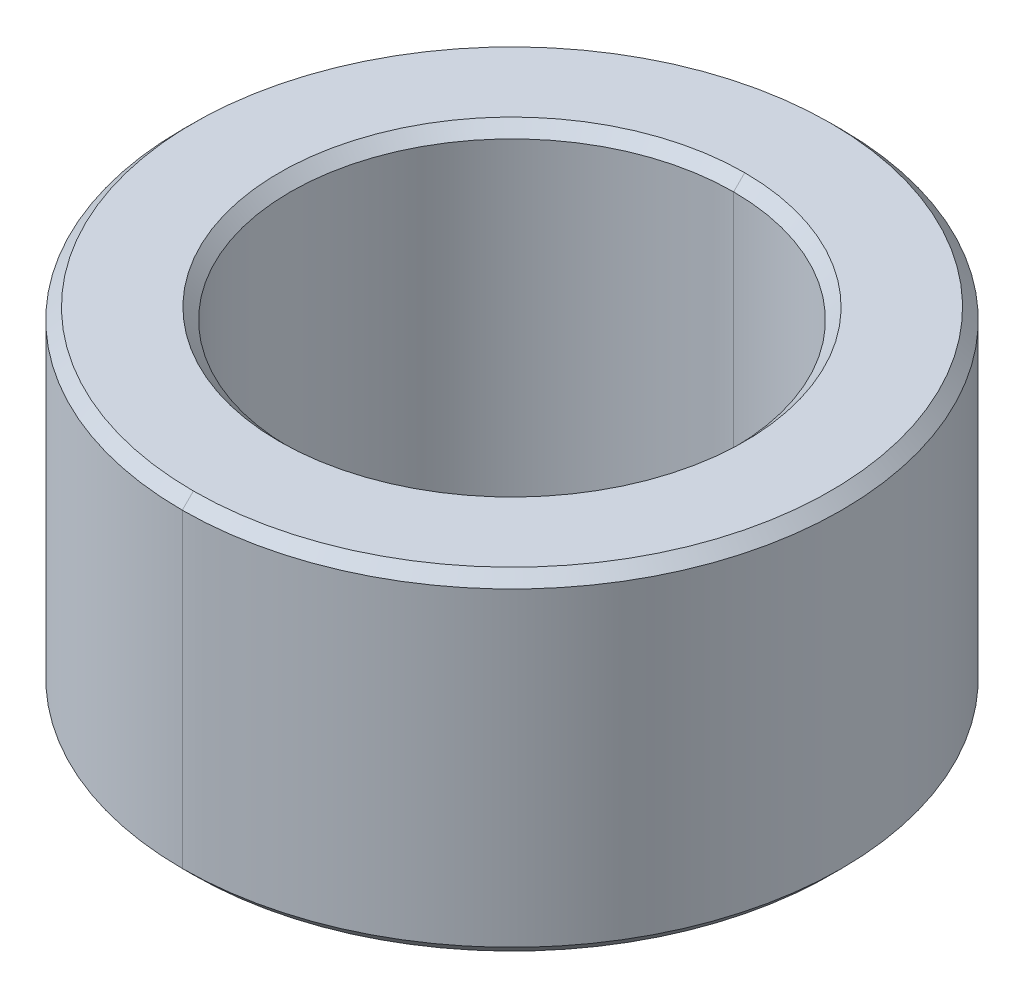
ISO-10303-21;
HEADER;
FILE_DESCRIPTION(('STEP AP214'),'2;1');
FILE_NAME('part.step','',(''),(''),'','','');
FILE_SCHEMA(('AUTOMOTIVE_DESIGN { 1 0 10303 214 1 1 1 1 }'));
ENDSEC;
DATA;
#1=APPLICATION_CONTEXT('core data for automotive mechanical design processes');
#2=APPLICATION_PROTOCOL_DEFINITION('international standard','automotive_design',2000,#1);
#3=PRODUCT_CONTEXT('',#1,'mechanical');
#4=PRODUCT('Part','Part','',(#3));
#5=PRODUCT_RELATED_PRODUCT_CATEGORY('part','',(#4));
#6=PRODUCT_DEFINITION_FORMATION('','',#4);
#7=PRODUCT_DEFINITION_CONTEXT('part definition',#1,'design');
#8=PRODUCT_DEFINITION('design','',#6,#7);
#9=PRODUCT_DEFINITION_SHAPE('','',#8);
#10=(LENGTH_UNIT() NAMED_UNIT(*) SI_UNIT(.MILLI.,.METRE.));
#11=(NAMED_UNIT(*) PLANE_ANGLE_UNIT() SI_UNIT($,.RADIAN.));
#12=(NAMED_UNIT(*) SI_UNIT($,.STERADIAN.) SOLID_ANGLE_UNIT());
#13=UNCERTAINTY_MEASURE_WITH_UNIT(LENGTH_MEASURE(1.E-05),#10,'distance_accuracy_value','');
#14=(GEOMETRIC_REPRESENTATION_CONTEXT(3) GLOBAL_UNCERTAINTY_ASSIGNED_CONTEXT((#13)) GLOBAL_UNIT_ASSIGNED_CONTEXT((#10,
#11,#12)) REPRESENTATION_CONTEXT('',''));
#15=CARTESIAN_POINT('',(0.,0.,0.));
#16=DIRECTION('',(0.,0.,1.));
#17=DIRECTION('',(1.,0.,0.));
#18=AXIS2_PLACEMENT_3D('',#15,#16,#17);
#19=CARTESIAN_POINT('',(0.,1.4,0.));
#20=DIRECTION('',(0.,1.,0.));
#21=DIRECTION('',(0.,0.,1.));
#22=AXIS2_PLACEMENT_3D('',#19,#20,#21);
#23=CONICAL_SURFACE('',#22,2.,0.78539816339745);
#24=CARTESIAN_POINT('',(0.,1.4,0.));
#25=DIRECTION('',(0.,1.,0.));
#26=DIRECTION('',(0.,0.,1.));
#27=AXIS2_PLACEMENT_3D('',#24,#25,#26);
#28=CIRCLE('',#27,2.);
#29=CARTESIAN_POINT('',(0.,1.4,-2.));
#30=VERTEX_POINT('',#29);
#31=CARTESIAN_POINT('',(0.,1.4,2.));
#32=VERTEX_POINT('',#31);
#33=EDGE_CURVE('E147',#30,#32,#28,.T.);
#34=ORIENTED_EDGE('',*,*,#33,.F.);
#35=DIRECTION('',(0.,0.707106781186546,-0.707106781186549));
#36=VECTOR('',#35,1.);
#37=CARTESIAN_POINT('',(0.,1.4,-2.));
#38=LINE('',#37,#36);
#39=CARTESIAN_POINT('',(0.,1.5,-2.1));
#40=VERTEX_POINT('',#39);
#41=EDGE_CURVE('E11',#30,#40,#38,.T.);
#42=ORIENTED_EDGE('',*,*,#41,.T.);
#43=CARTESIAN_POINT('',(0.,1.5,0.));
#44=DIRECTION('',(0.,-1.,0.));
#45=DIRECTION('',(0.,0.,1.));
#46=AXIS2_PLACEMENT_3D('',#43,#44,#45);
#47=CIRCLE('',#46,2.1);
#48=CARTESIAN_POINT('',(0.,1.5,2.1));
#49=VERTEX_POINT('',#48);
#50=EDGE_CURVE('E121',#49,#40,#47,.T.);
#51=ORIENTED_EDGE('',*,*,#50,.F.);
#52=DIRECTION('',(0.,0.707106781186546,0.707106781186549));
#53=VECTOR('',#52,1.);
#54=CARTESIAN_POINT('',(0.,1.4,2.));
#55=LINE('',#54,#53);
#56=EDGE_CURVE('E139',#32,#49,#55,.T.);
#57=ORIENTED_EDGE('',*,*,#56,.F.);
#58=EDGE_LOOP('',(#34,#42,#51,#57));
#59=FACE_BOUND('',#58,.T.);
#60=ADVANCED_FACE('F16',(#59),#23,.F.);
#61=CARTESIAN_POINT('',(0.,-1.5,0.));
#62=DIRECTION('',(0.,-1.,0.));
#63=DIRECTION('',(0.,0.,-1.));
#64=AXIS2_PLACEMENT_3D('',#61,#62,#63);
#65=CONICAL_SURFACE('',#64,2.1,0.78539816339744);
#66=CARTESIAN_POINT('',(0.,-1.4,0.));
#67=DIRECTION('',(0.,-1.,0.));
#68=DIRECTION('',(0.,0.,1.));
#69=AXIS2_PLACEMENT_3D('',#66,#67,#68);
#70=CIRCLE('',#69,2.);
#71=CARTESIAN_POINT('',(0.,-1.4,2.));
#72=VERTEX_POINT('',#71);
#73=CARTESIAN_POINT('',(0.,-1.4,-2.));
#74=VERTEX_POINT('',#73);
#75=EDGE_CURVE('E137',#72,#74,#70,.T.);
#76=ORIENTED_EDGE('',*,*,#75,.F.);
#77=DIRECTION('',(0.,-0.707106781186554,0.707106781186542));
#78=VECTOR('',#77,1.);
#79=CARTESIAN_POINT('',(0.,-1.5,2.1));
#80=LINE('',#79,#78);
#81=CARTESIAN_POINT('',(0.,-1.5,2.1));
#82=VERTEX_POINT('',#81);
#83=EDGE_CURVE('E27',#72,#82,#80,.T.);
#84=ORIENTED_EDGE('',*,*,#83,.T.);
#85=CARTESIAN_POINT('',(0.,-1.5,0.));
#86=DIRECTION('',(0.,1.,0.));
#87=DIRECTION('',(0.,0.,1.));
#88=AXIS2_PLACEMENT_3D('',#85,#86,#87);
#89=CIRCLE('',#88,2.1);
#90=CARTESIAN_POINT('',(0.,-1.5,-2.1));
#91=VERTEX_POINT('',#90);
#92=EDGE_CURVE('E169',#91,#82,#89,.T.);
#93=ORIENTED_EDGE('',*,*,#92,.F.);
#94=DIRECTION('',(0.,-0.707106781186554,-0.707106781186542));
#95=VECTOR('',#94,1.);
#96=CARTESIAN_POINT('',(0.,-1.5,-2.1));
#97=LINE('',#96,#95);
#98=EDGE_CURVE('E113',#74,#91,#97,.T.);
#99=ORIENTED_EDGE('',*,*,#98,.F.);
#100=EDGE_LOOP('',(#76,#84,#93,#99));
#101=FACE_BOUND('',#100,.T.);
#102=ADVANCED_FACE('F225',(#101),#65,.F.);
#103=CARTESIAN_POINT('',(0.,1.5,0.));
#104=DIRECTION('',(0.,-1.,0.));
#105=DIRECTION('',(0.,0.,-1.));
#106=AXIS2_PLACEMENT_3D('',#103,#104,#105);
#107=CONICAL_SURFACE('',#106,2.875,0.785398163397448);
#108=CARTESIAN_POINT('',(0.,1.5,0.));
#109=DIRECTION('',(0.,1.,0.));
#110=DIRECTION('',(0.,0.,1.));
#111=AXIS2_PLACEMENT_3D('',#108,#109,#110);
#112=CIRCLE('',#111,2.875);
#113=CARTESIAN_POINT('',(0.,1.5,2.875));
#114=VERTEX_POINT('',#113);
#115=CARTESIAN_POINT('',(0.,1.5,-2.875));
#116=VERTEX_POINT('',#115);
#117=EDGE_CURVE('E102',#114,#116,#112,.T.);
#118=ORIENTED_EDGE('',*,*,#117,.F.);
#119=DIRECTION('',(0.,-0.707106781186548,0.707106781186548));
#120=VECTOR('',#119,1.);
#121=CARTESIAN_POINT('',(0.,1.5,2.875));
#122=LINE('',#121,#120);
#123=CARTESIAN_POINT('',(0.,1.4,2.975));
#124=VERTEX_POINT('',#123);
#125=EDGE_CURVE('E123',#114,#124,#122,.T.);
#126=ORIENTED_EDGE('',*,*,#125,.T.);
#127=CARTESIAN_POINT('',(0.,1.4,0.));
#128=DIRECTION('',(0.,-1.,0.));
#129=DIRECTION('',(0.,0.,1.));
#130=AXIS2_PLACEMENT_3D('',#127,#128,#129);
#131=CIRCLE('',#130,2.975);
#132=CARTESIAN_POINT('',(0.,1.4,-2.975));
#133=VERTEX_POINT('',#132);
#134=EDGE_CURVE('E105',#133,#124,#131,.T.);
#135=ORIENTED_EDGE('',*,*,#134,.F.);
#136=DIRECTION('',(0.,-0.707106781186548,-0.707106781186548));
#137=VECTOR('',#136,1.);
#138=CARTESIAN_POINT('',(0.,1.5,-2.875));
#139=LINE('',#138,#137);
#140=EDGE_CURVE('E98',#116,#133,#139,.T.);
#141=ORIENTED_EDGE('',*,*,#140,.F.);
#142=EDGE_LOOP('',(#118,#126,#135,#141));
#143=FACE_BOUND('',#142,.T.);
#144=ADVANCED_FACE('F100',(#143),#107,.T.);
#145=CARTESIAN_POINT('',(0.,-1.4,0.));
#146=DIRECTION('',(0.,1.,0.));
#147=DIRECTION('',(0.,0.,1.));
#148=AXIS2_PLACEMENT_3D('',#145,#146,#147);
#149=CONICAL_SURFACE('',#148,2.975,0.785398163397448);
#150=CARTESIAN_POINT('',(0.,-1.5,0.));
#151=DIRECTION('',(0.,-1.,0.));
#152=DIRECTION('',(0.,0.,1.));
#153=AXIS2_PLACEMENT_3D('',#150,#151,#152);
#154=CIRCLE('',#153,2.875);
#155=CARTESIAN_POINT('',(0.,-1.5,-2.875));
#156=VERTEX_POINT('',#155);
#157=CARTESIAN_POINT('',(0.,-1.5,2.875));
#158=VERTEX_POINT('',#157);
#159=EDGE_CURVE('E161',#156,#158,#154,.T.);
#160=ORIENTED_EDGE('',*,*,#159,.F.);
#161=DIRECTION('',(0.,0.707106781186548,-0.707106781186548));
#162=VECTOR('',#161,1.);
#163=CARTESIAN_POINT('',(0.,-1.4,-2.975));
#164=LINE('',#163,#162);
#165=CARTESIAN_POINT('',(0.,-1.4,-2.975));
#166=VERTEX_POINT('',#165);
#167=EDGE_CURVE('E20',#156,#166,#164,.T.);
#168=ORIENTED_EDGE('',*,*,#167,.T.);
#169=CARTESIAN_POINT('',(0.,-1.4,0.));
#170=DIRECTION('',(0.,1.,0.));
#171=DIRECTION('',(0.,0.,1.));
#172=AXIS2_PLACEMENT_3D('',#169,#170,#171);
#173=CIRCLE('',#172,2.975);
#174=CARTESIAN_POINT('',(0.,-1.4,2.975));
#175=VERTEX_POINT('',#174);
#176=EDGE_CURVE('E125',#175,#166,#173,.T.);
#177=ORIENTED_EDGE('',*,*,#176,.F.);
#178=DIRECTION('',(0.,0.707106781186548,0.707106781186548));
#179=VECTOR('',#178,1.);
#180=CARTESIAN_POINT('',(0.,-1.4,2.975));
#181=LINE('',#180,#179);
#182=EDGE_CURVE('E112',#158,#175,#181,.T.);
#183=ORIENTED_EDGE('',*,*,#182,.F.);
#184=EDGE_LOOP('',(#160,#168,#177,#183));
#185=FACE_BOUND('',#184,.T.);
#186=ADVANCED_FACE('F267',(#185),#149,.T.);
#187=CARTESIAN_POINT('',(0.,1.5,0.));
#188=DIRECTION('',(0.,-1.,0.));
#189=DIRECTION('',(0.,0.,-1.));
#190=AXIS2_PLACEMENT_3D('',#187,#188,#189);
#191=CYLINDRICAL_SURFACE('',#190,2.);
#192=ORIENTED_EDGE('',*,*,#33,.T.);
#193=DIRECTION('',(0.,-1.,0.));
#194=VECTOR('',#193,1.);
#195=CARTESIAN_POINT('',(0.,1.5,2.));
#196=LINE('',#195,#194);
#197=EDGE_CURVE('E143',#32,#72,#196,.T.);
#198=ORIENTED_EDGE('',*,*,#197,.T.);
#199=ORIENTED_EDGE('',*,*,#75,.T.);
#200=DIRECTION('',(0.,-1.,0.));
#201=VECTOR('',#200,1.);
#202=CARTESIAN_POINT('',(0.,1.5,-2.));
#203=LINE('',#202,#201);
#204=EDGE_CURVE('E42',#30,#74,#203,.T.);
#205=ORIENTED_EDGE('',*,*,#204,.F.);
#206=EDGE_LOOP('',(#192,#198,#199,#205));
#207=FACE_BOUND('',#206,.T.);
#208=ADVANCED_FACE('F18',(#207),#191,.F.);
#209=CARTESIAN_POINT('',(0.,1.5,0.));
#210=DIRECTION('',(0.,-1.,0.));
#211=DIRECTION('',(0.,0.,-1.));
#212=AXIS2_PLACEMENT_3D('',#209,#210,#211);
#213=CYLINDRICAL_SURFACE('',#212,2.975);
#214=ORIENTED_EDGE('',*,*,#134,.T.);
#215=DIRECTION('',(0.,-1.,0.));
#216=VECTOR('',#215,1.);
#217=CARTESIAN_POINT('',(0.,1.5,2.975));
#218=LINE('',#217,#216);
#219=EDGE_CURVE('E133',#124,#175,#218,.T.);
#220=ORIENTED_EDGE('',*,*,#219,.T.);
#221=ORIENTED_EDGE('',*,*,#176,.T.);
#222=DIRECTION('',(0.,-1.,0.));
#223=VECTOR('',#222,1.);
#224=CARTESIAN_POINT('',(0.,1.5,-2.975));
#225=LINE('',#224,#223);
#226=EDGE_CURVE('E152',#133,#166,#225,.T.);
#227=ORIENTED_EDGE('',*,*,#226,.F.);
#228=EDGE_LOOP('',(#214,#220,#221,#227));
#229=FACE_BOUND('',#228,.T.);
#230=ADVANCED_FACE('F239',(#229),#213,.T.);
#231=CARTESIAN_POINT('',(0.,1.5,0.));
#232=DIRECTION('',(0.,1.,0.));
#233=DIRECTION('',(1.,0.,0.));
#234=AXIS2_PLACEMENT_3D('',#231,#232,#233);
#235=PLANE('',#234);
#236=CARTESIAN_POINT('',(0.,1.5,0.));
#237=DIRECTION('',(0.,1.,0.));
#238=DIRECTION('',(0.,0.,1.));
#239=AXIS2_PLACEMENT_3D('',#236,#237,#238);
#240=CIRCLE('',#239,2.875);
#241=EDGE_CURVE('E119',#116,#114,#240,.T.);
#242=ORIENTED_EDGE('',*,*,#241,.T.);
#243=ORIENTED_EDGE('',*,*,#117,.T.);
#244=EDGE_LOOP('',(#242,#243));
#245=FACE_BOUND('',#244,.T.);
#246=ORIENTED_EDGE('',*,*,#50,.T.);
#247=CARTESIAN_POINT('',(0.,1.5,0.));
#248=DIRECTION('',(0.,-1.,0.));
#249=DIRECTION('',(0.,0.,1.));
#250=AXIS2_PLACEMENT_3D('',#247,#248,#249);
#251=CIRCLE('',#250,2.1);
#252=EDGE_CURVE('E141',#40,#49,#251,.T.);
#253=ORIENTED_EDGE('',*,*,#252,.T.);
#254=EDGE_LOOP('',(#246,#253));
#255=FACE_BOUND('',#254,.T.);
#256=ADVANCED_FACE('F117',(#245,#255),#235,.T.);
#257=CARTESIAN_POINT('',(0.,-1.5,0.));
#258=DIRECTION('',(0.,1.,0.));
#259=DIRECTION('',(1.,0.,0.));
#260=AXIS2_PLACEMENT_3D('',#257,#258,#259);
#261=PLANE('',#260);
#262=CARTESIAN_POINT('',(0.,-1.5,0.));
#263=DIRECTION('',(0.,-1.,0.));
#264=DIRECTION('',(0.,0.,1.));
#265=AXIS2_PLACEMENT_3D('',#262,#263,#264);
#266=CIRCLE('',#265,2.875);
#267=EDGE_CURVE('E158',#158,#156,#266,.T.);
#268=ORIENTED_EDGE('',*,*,#267,.T.);
#269=ORIENTED_EDGE('',*,*,#159,.T.);
#270=EDGE_LOOP('',(#268,#269));
#271=FACE_BOUND('',#270,.T.);
#272=ORIENTED_EDGE('',*,*,#92,.T.);
#273=CARTESIAN_POINT('',(0.,-1.5,0.));
#274=DIRECTION('',(0.,1.,0.));
#275=DIRECTION('',(0.,0.,1.));
#276=AXIS2_PLACEMENT_3D('',#273,#274,#275);
#277=CIRCLE('',#276,2.1);
#278=EDGE_CURVE('E151',#82,#91,#277,.T.);
#279=ORIENTED_EDGE('',*,*,#278,.T.);
#280=EDGE_LOOP('',(#272,#279));
#281=FACE_BOUND('',#280,.T.);
#282=ADVANCED_FACE('F227',(#271,#281),#261,.F.);
#283=CARTESIAN_POINT('',(0.,1.5,0.));
#284=DIRECTION('',(0.,-1.,0.));
#285=DIRECTION('',(0.,0.,-1.));
#286=AXIS2_PLACEMENT_3D('',#283,#284,#285);
#287=CYLINDRICAL_SURFACE('',#286,2.975);
#288=ORIENTED_EDGE('',*,*,#219,.F.);
#289=CARTESIAN_POINT('',(0.,1.4,0.));
#290=DIRECTION('',(0.,-1.,0.));
#291=DIRECTION('',(0.,0.,1.));
#292=AXIS2_PLACEMENT_3D('',#289,#290,#291);
#293=CIRCLE('',#292,2.975);
#294=EDGE_CURVE('E148',#124,#133,#293,.T.);
#295=ORIENTED_EDGE('',*,*,#294,.T.);
#296=ORIENTED_EDGE('',*,*,#226,.T.);
#297=CARTESIAN_POINT('',(0.,-1.4,0.));
#298=DIRECTION('',(0.,1.,0.));
#299=DIRECTION('',(0.,0.,1.));
#300=AXIS2_PLACEMENT_3D('',#297,#298,#299);
#301=CIRCLE('',#300,2.975);
#302=EDGE_CURVE('E153',#166,#175,#301,.T.);
#303=ORIENTED_EDGE('',*,*,#302,.T.);
#304=EDGE_LOOP('',(#288,#295,#296,#303));
#305=FACE_BOUND('',#304,.T.);
#306=ADVANCED_FACE('F229',(#305),#287,.T.);
#307=CARTESIAN_POINT('',(0.,1.5,0.));
#308=DIRECTION('',(0.,-1.,0.));
#309=DIRECTION('',(0.,0.,-1.));
#310=AXIS2_PLACEMENT_3D('',#307,#308,#309);
#311=CYLINDRICAL_SURFACE('',#310,2.);
#312=ORIENTED_EDGE('',*,*,#197,.F.);
#313=CARTESIAN_POINT('',(0.,1.4,0.));
#314=DIRECTION('',(0.,1.,0.));
#315=DIRECTION('',(0.,0.,1.));
#316=AXIS2_PLACEMENT_3D('',#313,#314,#315);
#317=CIRCLE('',#316,2.);
#318=EDGE_CURVE('E157',#32,#30,#317,.T.);
#319=ORIENTED_EDGE('',*,*,#318,.T.);
#320=ORIENTED_EDGE('',*,*,#204,.T.);
#321=CARTESIAN_POINT('',(0.,-1.4,0.));
#322=DIRECTION('',(0.,-1.,0.));
#323=DIRECTION('',(0.,0.,1.));
#324=AXIS2_PLACEMENT_3D('',#321,#322,#323);
#325=CIRCLE('',#324,2.);
#326=EDGE_CURVE('E165',#74,#72,#325,.T.);
#327=ORIENTED_EDGE('',*,*,#326,.T.);
#328=EDGE_LOOP('',(#312,#319,#320,#327));
#329=FACE_BOUND('',#328,.T.);
#330=ADVANCED_FACE('F220',(#329),#311,.F.);
#331=CARTESIAN_POINT('',(0.,-1.4,0.));
#332=DIRECTION('',(0.,1.,0.));
#333=DIRECTION('',(0.,0.,1.));
#334=AXIS2_PLACEMENT_3D('',#331,#332,#333);
#335=CONICAL_SURFACE('',#334,2.975,0.785398163397448);
#336=ORIENTED_EDGE('',*,*,#167,.F.);
#337=ORIENTED_EDGE('',*,*,#267,.F.);
#338=ORIENTED_EDGE('',*,*,#182,.T.);
#339=ORIENTED_EDGE('',*,*,#302,.F.);
#340=EDGE_LOOP('',(#336,#337,#338,#339));
#341=FACE_BOUND('',#340,.T.);
#342=ADVANCED_FACE('F251',(#341),#335,.T.);
#343=CARTESIAN_POINT('',(0.,1.5,0.));
#344=DIRECTION('',(0.,-1.,0.));
#345=DIRECTION('',(0.,0.,-1.));
#346=AXIS2_PLACEMENT_3D('',#343,#344,#345);
#347=CONICAL_SURFACE('',#346,2.875,0.785398163397448);
#348=ORIENTED_EDGE('',*,*,#125,.F.);
#349=ORIENTED_EDGE('',*,*,#241,.F.);
#350=ORIENTED_EDGE('',*,*,#140,.T.);
#351=ORIENTED_EDGE('',*,*,#294,.F.);
#352=EDGE_LOOP('',(#348,#349,#350,#351));
#353=FACE_BOUND('',#352,.T.);
#354=ADVANCED_FACE('F122',(#353),#347,.T.);
#355=CARTESIAN_POINT('',(0.,-1.5,0.));
#356=DIRECTION('',(0.,-1.,0.));
#357=DIRECTION('',(0.,0.,-1.));
#358=AXIS2_PLACEMENT_3D('',#355,#356,#357);
#359=CONICAL_SURFACE('',#358,2.1,0.78539816339744);
#360=ORIENTED_EDGE('',*,*,#83,.F.);
#361=ORIENTED_EDGE('',*,*,#326,.F.);
#362=ORIENTED_EDGE('',*,*,#98,.T.);
#363=ORIENTED_EDGE('',*,*,#278,.F.);
#364=EDGE_LOOP('',(#360,#361,#362,#363));
#365=FACE_BOUND('',#364,.T.);
#366=ADVANCED_FACE('F217',(#365),#359,.F.);
#367=CARTESIAN_POINT('',(0.,1.4,0.));
#368=DIRECTION('',(0.,1.,0.));
#369=DIRECTION('',(0.,0.,1.));
#370=AXIS2_PLACEMENT_3D('',#367,#368,#369);
#371=CONICAL_SURFACE('',#370,2.,0.78539816339745);
#372=ORIENTED_EDGE('',*,*,#41,.F.);
#373=ORIENTED_EDGE('',*,*,#318,.F.);
#374=ORIENTED_EDGE('',*,*,#56,.T.);
#375=ORIENTED_EDGE('',*,*,#252,.F.);
#376=EDGE_LOOP('',(#372,#373,#374,#375));
#377=FACE_BOUND('',#376,.T.);
#378=ADVANCED_FACE('F208',(#377),#371,.F.);
#379=CLOSED_SHELL('',(#60,#102,#144,#186,#208,#230,#256,#282,#306,#330,#342,#354,#366,#378));
#380=MANIFOLD_SOLID_BREP('B1',#379);
#381=ADVANCED_BREP_SHAPE_REPRESENTATION('',(#18,#380),#14);
#382=SHAPE_DEFINITION_REPRESENTATION(#9,#381);
ENDSEC;
END-ISO-10303-21;
